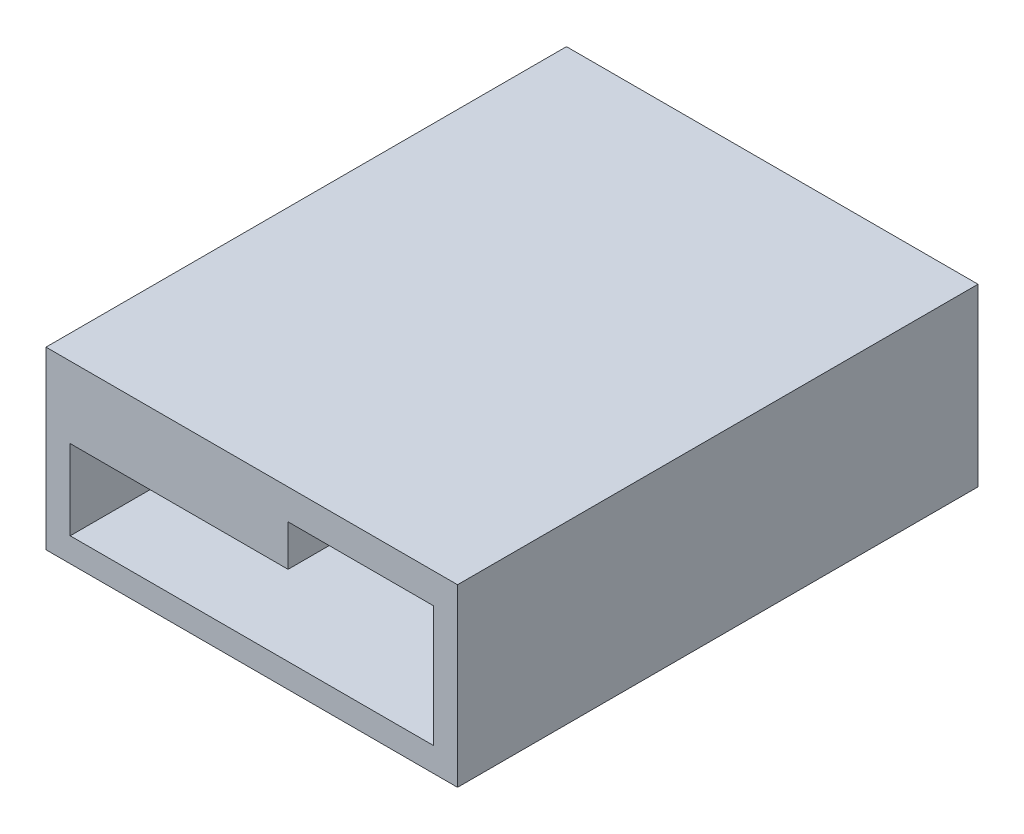
ISO-10303-21;
HEADER;
FILE_DESCRIPTION(('STEP AP214'),'2;1');
FILE_NAME('part.step','',(''),(''),'','','');
FILE_SCHEMA(('AUTOMOTIVE_DESIGN { 1 0 10303 214 1 1 1 1 }'));
ENDSEC;
DATA;
#1=APPLICATION_CONTEXT('core data for automotive mechanical design processes');
#2=APPLICATION_PROTOCOL_DEFINITION('international standard','automotive_design',2000,#1);
#3=PRODUCT_CONTEXT('',#1,'mechanical');
#4=PRODUCT('Part','Part','',(#3));
#5=PRODUCT_RELATED_PRODUCT_CATEGORY('part','',(#4));
#6=PRODUCT_DEFINITION_FORMATION('','',#4);
#7=PRODUCT_DEFINITION_CONTEXT('part definition',#1,'design');
#8=PRODUCT_DEFINITION('design','',#6,#7);
#9=PRODUCT_DEFINITION_SHAPE('','',#8);
#10=(LENGTH_UNIT() NAMED_UNIT(*) SI_UNIT(.MILLI.,.METRE.));
#11=(NAMED_UNIT(*) PLANE_ANGLE_UNIT() SI_UNIT($,.RADIAN.));
#12=(NAMED_UNIT(*) SI_UNIT($,.STERADIAN.) SOLID_ANGLE_UNIT());
#13=UNCERTAINTY_MEASURE_WITH_UNIT(LENGTH_MEASURE(1.E-05),#10,'distance_accuracy_value','');
#14=(GEOMETRIC_REPRESENTATION_CONTEXT(3) GLOBAL_UNCERTAINTY_ASSIGNED_CONTEXT((#13)) GLOBAL_UNIT_ASSIGNED_CONTEXT((#10,
#11,#12)) REPRESENTATION_CONTEXT('',''));
#15=CARTESIAN_POINT('',(0.,0.,0.));
#16=DIRECTION('',(0.,0.,1.));
#17=DIRECTION('',(1.,0.,0.));
#18=AXIS2_PLACEMENT_3D('',#15,#16,#17);
#19=CARTESIAN_POINT('',(0.,3.4,0.));
#20=DIRECTION('',(0.,-1.,0.));
#21=DIRECTION('',(0.,0.,-1.));
#22=AXIS2_PLACEMENT_3D('',#19,#20,#21);
#23=PLANE('',#22);
#24=DIRECTION('',(-1.,0.,0.));
#25=VECTOR('',#24,1.);
#26=CARTESIAN_POINT('',(-15.5,3.4,-47.));
#27=LINE('',#26,#25);
#28=CARTESIAN_POINT('',(14.5,3.4,-47.));
#29=VERTEX_POINT('',#28);
#30=CARTESIAN_POINT('',(9.5,3.4,-47.));
#31=VERTEX_POINT('',#30);
#32=EDGE_CURVE('E165',#29,#31,#27,.T.);
#33=ORIENTED_EDGE('',*,*,#32,.F.);
#34=DIRECTION('',(0.,0.,-1.));
#35=VECTOR('',#34,1.);
#36=CARTESIAN_POINT('',(14.5,3.4,-47.));
#37=LINE('',#36,#35);
#38=CARTESIAN_POINT('',(14.5,3.4,-6.));
#39=VERTEX_POINT('',#38);
#40=EDGE_CURVE('E159',#39,#29,#37,.T.);
#41=ORIENTED_EDGE('',*,*,#40,.F.);
#42=DIRECTION('',(1.,0.,0.));
#43=VECTOR('',#42,1.);
#44=CARTESIAN_POINT('',(-17.5,3.4,-6.));
#45=LINE('',#44,#43);
#46=CARTESIAN_POINT('',(2.5,3.4,-6.));
#47=VERTEX_POINT('',#46);
#48=EDGE_CURVE('E182',#47,#39,#45,.T.);
#49=ORIENTED_EDGE('',*,*,#48,.F.);
#50=DIRECTION('',(0.,0.,-1.));
#51=VECTOR('',#50,1.);
#52=CARTESIAN_POINT('',(2.5,3.4,-6.));
#53=LINE('',#52,#51);
#54=CARTESIAN_POINT('',(2.5,3.4,-35.));
#55=VERTEX_POINT('',#54);
#56=EDGE_CURVE('E196',#47,#55,#53,.T.);
#57=ORIENTED_EDGE('',*,*,#56,.T.);
#58=DIRECTION('',(1.,0.,0.));
#59=VECTOR('',#58,1.);
#60=CARTESIAN_POINT('',(2.5,3.4,-35.));
#61=LINE('',#60,#59);
#62=CARTESIAN_POINT('',(9.5,3.4,-35.));
#63=VERTEX_POINT('',#62);
#64=EDGE_CURVE('E199',#55,#63,#61,.T.);
#65=ORIENTED_EDGE('',*,*,#64,.T.);
#66=DIRECTION('',(0.,0.,-1.));
#67=VECTOR('',#66,1.);
#68=CARTESIAN_POINT('',(9.5,3.4,-35.));
#69=LINE('',#68,#67);
#70=EDGE_CURVE('E202',#63,#31,#69,.T.);
#71=ORIENTED_EDGE('',*,*,#70,.T.);
#72=EDGE_LOOP('',(#33,#41,#49,#57,#65,#71));
#73=FACE_BOUND('',#72,.T.);
#74=ADVANCED_FACE('F35',(#73),#23,.T.);
#75=CARTESIAN_POINT('',(2.5,0.4,-35.));
#76=DIRECTION('',(-1.,0.,0.));
#77=DIRECTION('',(0.,0.,1.));
#78=AXIS2_PLACEMENT_3D('',#75,#76,#77);
#79=PLANE('',#78);
#80=DIRECTION('',(0.,0.,-1.));
#81=VECTOR('',#80,1.);
#82=CARTESIAN_POINT('',(2.5,0.,-35.));
#83=LINE('',#82,#81);
#84=CARTESIAN_POINT('',(2.5,0.,-6.));
#85=VERTEX_POINT('',#84);
#86=CARTESIAN_POINT('',(2.5,0.,-35.));
#87=VERTEX_POINT('',#86);
#88=EDGE_CURVE('E205',#85,#87,#83,.T.);
#89=ORIENTED_EDGE('',*,*,#88,.T.);
#90=DIRECTION('',(0.,-1.,0.));
#91=VECTOR('',#90,1.);
#92=CARTESIAN_POINT('',(2.5,0.4,-35.));
#93=LINE('',#92,#91);
#94=EDGE_CURVE('E43',#55,#87,#93,.T.);
#95=ORIENTED_EDGE('',*,*,#94,.F.);
#96=ORIENTED_EDGE('',*,*,#56,.F.);
#97=DIRECTION('',(0.,-1.,0.));
#98=VECTOR('',#97,1.);
#99=CARTESIAN_POINT('',(2.5,0.4,-6.));
#100=LINE('',#99,#98);
#101=EDGE_CURVE('E11',#47,#85,#100,.T.);
#102=ORIENTED_EDGE('',*,*,#101,.T.);
#103=EDGE_LOOP('',(#89,#95,#96,#102));
#104=FACE_BOUND('',#103,.T.);
#105=ADVANCED_FACE('F37',(#104),#79,.F.);
#106=CARTESIAN_POINT('',(9.50000000000001,0.4,-35.));
#107=DIRECTION('',(0.,0.,-1.));
#108=DIRECTION('',(-1.,0.,0.));
#109=AXIS2_PLACEMENT_3D('',#106,#107,#108);
#110=PLANE('',#109);
#111=DIRECTION('',(1.,0.,0.));
#112=VECTOR('',#111,1.);
#113=CARTESIAN_POINT('',(9.50000000000001,0.,-35.));
#114=LINE('',#113,#112);
#115=CARTESIAN_POINT('',(9.50000000000001,0.,-35.));
#116=VERTEX_POINT('',#115);
#117=EDGE_CURVE('E58',#87,#116,#114,.T.);
#118=ORIENTED_EDGE('',*,*,#117,.T.);
#119=DIRECTION('',(0.,-1.,0.));
#120=VECTOR('',#119,1.);
#121=CARTESIAN_POINT('',(9.50000000000001,0.4,-35.));
#122=LINE('',#121,#120);
#123=EDGE_CURVE('E219',#63,#116,#122,.T.);
#124=ORIENTED_EDGE('',*,*,#123,.F.);
#125=ORIENTED_EDGE('',*,*,#64,.F.);
#126=ORIENTED_EDGE('',*,*,#94,.T.);
#127=EDGE_LOOP('',(#118,#124,#125,#126));
#128=FACE_BOUND('',#127,.T.);
#129=ADVANCED_FACE('F221',(#128),#110,.F.);
#130=CARTESIAN_POINT('',(9.5,0.4,-47.));
#131=DIRECTION('',(-1.,0.,0.));
#132=DIRECTION('',(0.,0.,1.));
#133=AXIS2_PLACEMENT_3D('',#130,#131,#132);
#134=PLANE('',#133);
#135=DIRECTION('',(0.,0.,-1.));
#136=VECTOR('',#135,1.);
#137=CARTESIAN_POINT('',(9.5,0.,-47.));
#138=LINE('',#137,#136);
#139=CARTESIAN_POINT('',(9.5,0.,-47.));
#140=VERTEX_POINT('',#139);
#141=EDGE_CURVE('E208',#116,#140,#138,.T.);
#142=ORIENTED_EDGE('',*,*,#141,.T.);
#143=DIRECTION('',(0.,-1.,0.));
#144=VECTOR('',#143,1.);
#145=CARTESIAN_POINT('',(9.5,0.4,-47.));
#146=LINE('',#145,#144);
#147=EDGE_CURVE('E217',#31,#140,#146,.T.);
#148=ORIENTED_EDGE('',*,*,#147,.F.);
#149=ORIENTED_EDGE('',*,*,#70,.F.);
#150=ORIENTED_EDGE('',*,*,#123,.T.);
#151=EDGE_LOOP('',(#142,#148,#149,#150));
#152=FACE_BOUND('',#151,.T.);
#153=ADVANCED_FACE('F233',(#152),#134,.F.);
#154=CARTESIAN_POINT('',(-11.,0.4,-6.));
#155=DIRECTION('',(0.,0.,-1.));
#156=DIRECTION('',(-1.,0.,0.));
#157=AXIS2_PLACEMENT_3D('',#154,#155,#156);
#158=PLANE('',#157);
#159=DIRECTION('',(0.,-1.,0.));
#160=VECTOR('',#159,1.);
#161=CARTESIAN_POINT('',(-17.5,5.9,-6.));
#162=LINE('',#161,#160);
#163=CARTESIAN_POINT('',(-17.5,5.9,-6.));
#164=VERTEX_POINT('',#163);
#165=CARTESIAN_POINT('',(-17.5,-8.6,-6.));
#166=VERTEX_POINT('',#165);
#167=EDGE_CURVE('E136',#164,#166,#162,.T.);
#168=ORIENTED_EDGE('',*,*,#167,.T.);
#169=DIRECTION('',(-1.,0.,0.));
#170=VECTOR('',#169,1.);
#171=CARTESIAN_POINT('',(16.5,-8.6,-6.));
#172=LINE('',#171,#170);
#173=CARTESIAN_POINT('',(16.5,-8.6,-6.));
#174=VERTEX_POINT('',#173);
#175=EDGE_CURVE('E140',#174,#166,#172,.T.);
#176=ORIENTED_EDGE('',*,*,#175,.F.);
#177=DIRECTION('',(0.,-1.,0.));
#178=VECTOR('',#177,1.);
#179=CARTESIAN_POINT('',(16.5,5.9,-6.));
#180=LINE('',#179,#178);
#181=CARTESIAN_POINT('',(16.5,5.9,-6.));
#182=VERTEX_POINT('',#181);
#183=EDGE_CURVE('E126',#182,#174,#180,.T.);
#184=ORIENTED_EDGE('',*,*,#183,.F.);
#185=DIRECTION('',(1.,0.,0.));
#186=VECTOR('',#185,1.);
#187=CARTESIAN_POINT('',(-17.5,5.9,-6.));
#188=LINE('',#187,#186);
#189=EDGE_CURVE('E137',#164,#182,#188,.T.);
#190=ORIENTED_EDGE('',*,*,#189,.F.);
#191=EDGE_LOOP('',(#168,#176,#184,#190));
#192=FACE_BOUND('',#191,.T.);
#193=DIRECTION('',(1.,0.,0.));
#194=VECTOR('',#193,1.);
#195=CARTESIAN_POINT('',(-11.,0.,-6.));
#196=LINE('',#195,#194);
#197=CARTESIAN_POINT('',(-15.5,0.,-6.));
#198=VERTEX_POINT('',#197);
#199=EDGE_CURVE('E215',#198,#85,#196,.T.);
#200=ORIENTED_EDGE('',*,*,#199,.T.);
#201=ORIENTED_EDGE('',*,*,#101,.F.);
#202=ORIENTED_EDGE('',*,*,#48,.T.);
#203=DIRECTION('',(0.,1.,0.));
#204=VECTOR('',#203,1.);
#205=CARTESIAN_POINT('',(14.5,-6.6,-6.));
#206=LINE('',#205,#204);
#207=CARTESIAN_POINT('',(14.5,-6.6,-6.));
#208=VERTEX_POINT('',#207);
#209=EDGE_CURVE('E177',#208,#39,#206,.T.);
#210=ORIENTED_EDGE('',*,*,#209,.F.);
#211=DIRECTION('',(-1.,0.,0.));
#212=VECTOR('',#211,1.);
#213=CARTESIAN_POINT('',(16.5,-6.6,-6.));
#214=LINE('',#213,#212);
#215=CARTESIAN_POINT('',(-15.5,-6.6,-6.));
#216=VERTEX_POINT('',#215);
#217=EDGE_CURVE('E153',#208,#216,#214,.T.);
#218=ORIENTED_EDGE('',*,*,#217,.T.);
#219=DIRECTION('',(0.,1.,0.));
#220=VECTOR('',#219,1.);
#221=CARTESIAN_POINT('',(-15.5,-6.6,-6.));
#222=LINE('',#221,#220);
#223=EDGE_CURVE('E179',#216,#198,#222,.T.);
#224=ORIENTED_EDGE('',*,*,#223,.T.);
#225=EDGE_LOOP('',(#200,#201,#202,#210,#218,#224));
#226=FACE_BOUND('',#225,.T.);
#227=ADVANCED_FACE('F141',(#192,#226),#158,.F.);
#228=CARTESIAN_POINT('',(0.,0.,0.));
#229=DIRECTION('',(0.,1.,0.));
#230=DIRECTION('',(0.,0.,1.));
#231=AXIS2_PLACEMENT_3D('',#228,#229,#230);
#232=PLANE('',#231);
#233=ORIENTED_EDGE('',*,*,#88,.F.);
#234=ORIENTED_EDGE('',*,*,#199,.F.);
#235=DIRECTION('',(0.,0.,1.));
#236=VECTOR('',#235,1.);
#237=CARTESIAN_POINT('',(-15.5,0.,-6.));
#238=LINE('',#237,#236);
#239=CARTESIAN_POINT('',(-15.5,0.,-47.));
#240=VERTEX_POINT('',#239);
#241=EDGE_CURVE('E213',#240,#198,#238,.T.);
#242=ORIENTED_EDGE('',*,*,#241,.F.);
#243=DIRECTION('',(-1.,0.,0.));
#244=VECTOR('',#243,1.);
#245=CARTESIAN_POINT('',(-15.5,0.,-47.));
#246=LINE('',#245,#244);
#247=EDGE_CURVE('E211',#140,#240,#246,.T.);
#248=ORIENTED_EDGE('',*,*,#247,.F.);
#249=ORIENTED_EDGE('',*,*,#141,.F.);
#250=ORIENTED_EDGE('',*,*,#117,.F.);
#251=EDGE_LOOP('',(#233,#234,#242,#248,#249,#250));
#252=FACE_BOUND('',#251,.T.);
#253=ADVANCED_FACE('F227',(#252),#232,.F.);
#254=CARTESIAN_POINT('',(16.5,5.9,-6.));
#255=DIRECTION('',(-1.,0.,0.));
#256=DIRECTION('',(0.,0.,1.));
#257=AXIS2_PLACEMENT_3D('',#254,#255,#256);
#258=PLANE('',#257);
#259=ORIENTED_EDGE('',*,*,#183,.T.);
#260=DIRECTION('',(0.,0.,1.));
#261=VECTOR('',#260,1.);
#262=CARTESIAN_POINT('',(16.5,-8.6,-49.));
#263=LINE('',#262,#261);
#264=CARTESIAN_POINT('',(16.5,-8.6,-49.));
#265=VERTEX_POINT('',#264);
#266=EDGE_CURVE('E131',#265,#174,#263,.T.);
#267=ORIENTED_EDGE('',*,*,#266,.F.);
#268=DIRECTION('',(0.,-1.,0.));
#269=VECTOR('',#268,1.);
#270=CARTESIAN_POINT('',(16.5,5.9,-49.));
#271=LINE('',#270,#269);
#272=CARTESIAN_POINT('',(16.5,5.9,-49.));
#273=VERTEX_POINT('',#272);
#274=EDGE_CURVE('E194',#273,#265,#271,.T.);
#275=ORIENTED_EDGE('',*,*,#274,.F.);
#276=DIRECTION('',(0.,0.,-1.));
#277=VECTOR('',#276,1.);
#278=CARTESIAN_POINT('',(16.5,5.9,-6.));
#279=LINE('',#278,#277);
#280=EDGE_CURVE('E133',#182,#273,#279,.T.);
#281=ORIENTED_EDGE('',*,*,#280,.F.);
#282=EDGE_LOOP('',(#259,#267,#275,#281));
#283=FACE_BOUND('',#282,.T.);
#284=ADVANCED_FACE('F128',(#283),#258,.F.);
#285=CARTESIAN_POINT('',(-17.5,5.9,-49.));
#286=DIRECTION('',(0.,0.,1.));
#287=DIRECTION('',(1.,0.,0.));
#288=AXIS2_PLACEMENT_3D('',#285,#286,#287);
#289=PLANE('',#288);
#290=ORIENTED_EDGE('',*,*,#274,.T.);
#291=DIRECTION('',(1.,0.,0.));
#292=VECTOR('',#291,1.);
#293=CARTESIAN_POINT('',(16.5,-8.6,-49.));
#294=LINE('',#293,#292);
#295=CARTESIAN_POINT('',(-17.5,-8.6,-49.));
#296=VERTEX_POINT('',#295);
#297=EDGE_CURVE('E152',#296,#265,#294,.T.);
#298=ORIENTED_EDGE('',*,*,#297,.F.);
#299=DIRECTION('',(0.,-1.,0.));
#300=VECTOR('',#299,1.);
#301=CARTESIAN_POINT('',(-17.5,5.9,-49.));
#302=LINE('',#301,#300);
#303=CARTESIAN_POINT('',(-17.5,5.9,-49.));
#304=VERTEX_POINT('',#303);
#305=EDGE_CURVE('E192',#304,#296,#302,.T.);
#306=ORIENTED_EDGE('',*,*,#305,.F.);
#307=DIRECTION('',(-1.,0.,0.));
#308=VECTOR('',#307,1.);
#309=CARTESIAN_POINT('',(-17.5,5.9,-49.));
#310=LINE('',#309,#308);
#311=EDGE_CURVE('E184',#273,#304,#310,.T.);
#312=ORIENTED_EDGE('',*,*,#311,.F.);
#313=EDGE_LOOP('',(#290,#298,#306,#312));
#314=FACE_BOUND('',#313,.T.);
#315=ADVANCED_FACE('F269',(#314),#289,.F.);
#316=CARTESIAN_POINT('',(-17.5,5.9,-6.));
#317=DIRECTION('',(1.,0.,0.));
#318=DIRECTION('',(0.,0.,-1.));
#319=AXIS2_PLACEMENT_3D('',#316,#317,#318);
#320=PLANE('',#319);
#321=ORIENTED_EDGE('',*,*,#305,.T.);
#322=DIRECTION('',(0.,0.,-1.));
#323=VECTOR('',#322,1.);
#324=CARTESIAN_POINT('',(-17.5,-8.6,-49.));
#325=LINE('',#324,#323);
#326=EDGE_CURVE('E147',#166,#296,#325,.T.);
#327=ORIENTED_EDGE('',*,*,#326,.F.);
#328=ORIENTED_EDGE('',*,*,#167,.F.);
#329=DIRECTION('',(0.,0.,1.));
#330=VECTOR('',#329,1.);
#331=CARTESIAN_POINT('',(-17.5,5.9,-6.));
#332=LINE('',#331,#330);
#333=EDGE_CURVE('E186',#304,#164,#332,.T.);
#334=ORIENTED_EDGE('',*,*,#333,.F.);
#335=EDGE_LOOP('',(#321,#327,#328,#334));
#336=FACE_BOUND('',#335,.T.);
#337=ADVANCED_FACE('F266',(#336),#320,.F.);
#338=CARTESIAN_POINT('',(0.,5.9,0.));
#339=DIRECTION('',(0.,-1.,0.));
#340=DIRECTION('',(0.,0.,-1.));
#341=AXIS2_PLACEMENT_3D('',#338,#339,#340);
#342=PLANE('',#341);
#343=ORIENTED_EDGE('',*,*,#280,.T.);
#344=ORIENTED_EDGE('',*,*,#311,.T.);
#345=ORIENTED_EDGE('',*,*,#333,.T.);
#346=ORIENTED_EDGE('',*,*,#189,.T.);
#347=EDGE_LOOP('',(#343,#344,#345,#346));
#348=FACE_BOUND('',#347,.T.);
#349=ADVANCED_FACE('F265',(#348),#342,.F.);
#350=CARTESIAN_POINT('',(-15.5,-6.6,-6.));
#351=DIRECTION('',(-1.,0.,0.));
#352=DIRECTION('',(0.,0.,1.));
#353=AXIS2_PLACEMENT_3D('',#350,#351,#352);
#354=PLANE('',#353);
#355=DIRECTION('',(0.,1.,0.));
#356=VECTOR('',#355,1.);
#357=CARTESIAN_POINT('',(-15.5,-6.6,-47.));
#358=LINE('',#357,#356);
#359=CARTESIAN_POINT('',(-15.5,-6.6,-47.));
#360=VERTEX_POINT('',#359);
#361=EDGE_CURVE('E171',#360,#240,#358,.T.);
#362=ORIENTED_EDGE('',*,*,#361,.T.);
#363=ORIENTED_EDGE('',*,*,#241,.T.);
#364=ORIENTED_EDGE('',*,*,#223,.F.);
#365=DIRECTION('',(0.,0.,1.));
#366=VECTOR('',#365,1.);
#367=CARTESIAN_POINT('',(-15.5,-6.6,-6.));
#368=LINE('',#367,#366);
#369=EDGE_CURVE('E161',#360,#216,#368,.T.);
#370=ORIENTED_EDGE('',*,*,#369,.F.);
#371=EDGE_LOOP('',(#362,#363,#364,#370));
#372=FACE_BOUND('',#371,.T.);
#373=ADVANCED_FACE('F240',(#372),#354,.F.);
#374=CARTESIAN_POINT('',(-15.5,-6.6,-47.));
#375=DIRECTION('',(0.,0.,-1.));
#376=DIRECTION('',(-1.,0.,0.));
#377=AXIS2_PLACEMENT_3D('',#374,#375,#376);
#378=PLANE('',#377);
#379=ORIENTED_EDGE('',*,*,#32,.T.);
#380=ORIENTED_EDGE('',*,*,#147,.T.);
#381=ORIENTED_EDGE('',*,*,#247,.T.);
#382=ORIENTED_EDGE('',*,*,#361,.F.);
#383=DIRECTION('',(-1.,0.,0.));
#384=VECTOR('',#383,1.);
#385=CARTESIAN_POINT('',(-15.5,-6.6,-47.));
#386=LINE('',#385,#384);
#387=CARTESIAN_POINT('',(14.5,-6.6,-47.));
#388=VERTEX_POINT('',#387);
#389=EDGE_CURVE('E168',#388,#360,#386,.T.);
#390=ORIENTED_EDGE('',*,*,#389,.F.);
#391=DIRECTION('',(0.,1.,0.));
#392=VECTOR('',#391,1.);
#393=CARTESIAN_POINT('',(14.5,-6.6,-47.));
#394=LINE('',#393,#392);
#395=EDGE_CURVE('E50',#388,#29,#394,.T.);
#396=ORIENTED_EDGE('',*,*,#395,.T.);
#397=EDGE_LOOP('',(#379,#380,#381,#382,#390,#396));
#398=FACE_BOUND('',#397,.T.);
#399=ADVANCED_FACE('F242',(#398),#378,.F.);
#400=CARTESIAN_POINT('',(14.5,-6.6,-47.));
#401=DIRECTION('',(1.,0.,0.));
#402=DIRECTION('',(0.,0.,-1.));
#403=AXIS2_PLACEMENT_3D('',#400,#401,#402);
#404=PLANE('',#403);
#405=ORIENTED_EDGE('',*,*,#40,.T.);
#406=ORIENTED_EDGE('',*,*,#395,.F.);
#407=DIRECTION('',(0.,0.,-1.));
#408=VECTOR('',#407,1.);
#409=CARTESIAN_POINT('',(14.5,-6.6,-47.));
#410=LINE('',#409,#408);
#411=EDGE_CURVE('E164',#208,#388,#410,.T.);
#412=ORIENTED_EDGE('',*,*,#411,.F.);
#413=ORIENTED_EDGE('',*,*,#209,.T.);
#414=EDGE_LOOP('',(#405,#406,#412,#413));
#415=FACE_BOUND('',#414,.T.);
#416=ADVANCED_FACE('F248',(#415),#404,.F.);
#417=CARTESIAN_POINT('',(0.,-6.6,0.));
#418=DIRECTION('',(0.,-1.,0.));
#419=DIRECTION('',(0.,0.,-1.));
#420=AXIS2_PLACEMENT_3D('',#417,#418,#419);
#421=PLANE('',#420);
#422=ORIENTED_EDGE('',*,*,#389,.T.);
#423=ORIENTED_EDGE('',*,*,#369,.T.);
#424=ORIENTED_EDGE('',*,*,#217,.F.);
#425=ORIENTED_EDGE('',*,*,#411,.T.);
#426=EDGE_LOOP('',(#422,#423,#424,#425));
#427=FACE_BOUND('',#426,.T.);
#428=ADVANCED_FACE('F244',(#427),#421,.F.);
#429=CARTESIAN_POINT('',(0.,-8.6,0.));
#430=DIRECTION('',(0.,-1.,0.));
#431=DIRECTION('',(0.,0.,-1.));
#432=AXIS2_PLACEMENT_3D('',#429,#430,#431);
#433=PLANE('',#432);
#434=ORIENTED_EDGE('',*,*,#266,.T.);
#435=ORIENTED_EDGE('',*,*,#175,.T.);
#436=ORIENTED_EDGE('',*,*,#326,.T.);
#437=ORIENTED_EDGE('',*,*,#297,.T.);
#438=EDGE_LOOP('',(#434,#435,#436,#437));
#439=FACE_BOUND('',#438,.T.);
#440=ADVANCED_FACE('F150',(#439),#433,.T.);
#441=CLOSED_SHELL('',(#74,#105,#129,#153,#227,#253,#284,#315,#337,#349,#373,#399,#416,#428,#440));
#442=MANIFOLD_SOLID_BREP('B2',#441);
#443=ADVANCED_BREP_SHAPE_REPRESENTATION('',(#18,#442),#14);
#444=SHAPE_DEFINITION_REPRESENTATION(#9,#443);
ENDSEC;
END-ISO-10303-21;
